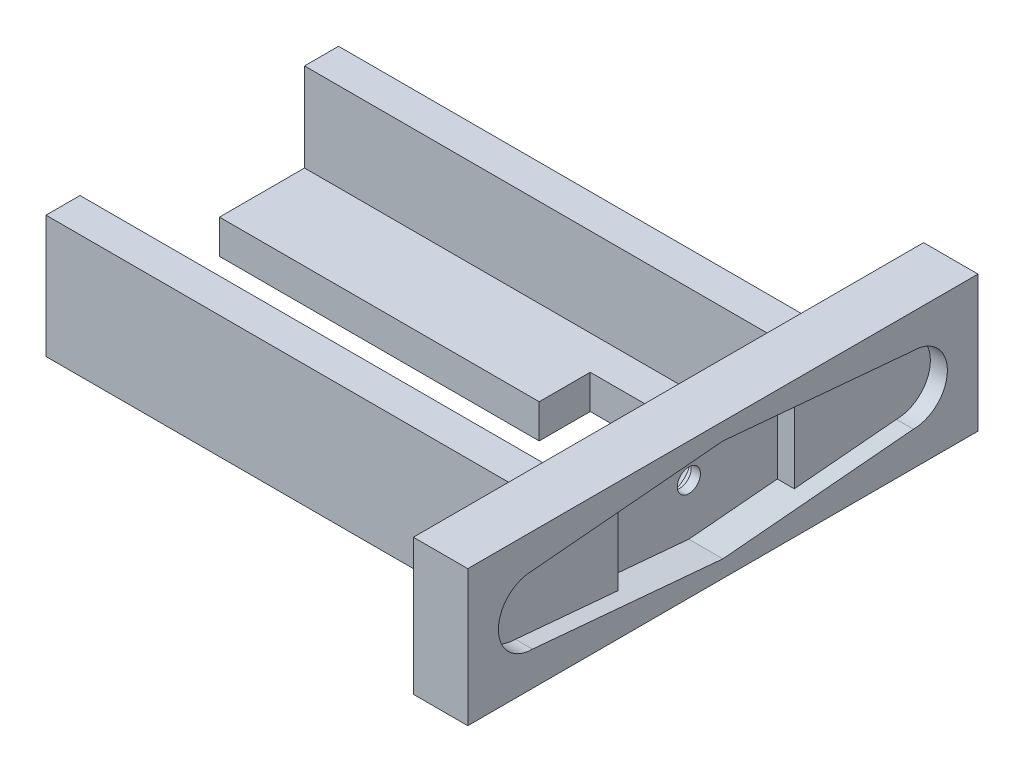
ISO-10303-21;
HEADER;
FILE_DESCRIPTION(('STEP AP214'),'2;1');
FILE_NAME('part.step','',(''),(''),'','','');
FILE_SCHEMA(('AUTOMOTIVE_DESIGN { 1 0 10303 214 1 1 1 1 }'));
ENDSEC;
DATA;
#1=APPLICATION_CONTEXT('core data for automotive mechanical design processes');
#2=APPLICATION_PROTOCOL_DEFINITION('international standard','automotive_design',2000,#1);
#3=PRODUCT_CONTEXT('',#1,'mechanical');
#4=PRODUCT('Part','Part','',(#3));
#5=PRODUCT_RELATED_PRODUCT_CATEGORY('part','',(#4));
#6=PRODUCT_DEFINITION_FORMATION('','',#4);
#7=PRODUCT_DEFINITION_CONTEXT('part definition',#1,'design');
#8=PRODUCT_DEFINITION('design','',#6,#7);
#9=PRODUCT_DEFINITION_SHAPE('','',#8);
#10=(LENGTH_UNIT() NAMED_UNIT(*) SI_UNIT(.MILLI.,.METRE.));
#11=(NAMED_UNIT(*) PLANE_ANGLE_UNIT() SI_UNIT($,.RADIAN.));
#12=(NAMED_UNIT(*) SI_UNIT($,.STERADIAN.) SOLID_ANGLE_UNIT());
#13=UNCERTAINTY_MEASURE_WITH_UNIT(LENGTH_MEASURE(1.E-05),#10,'distance_accuracy_value','');
#14=(GEOMETRIC_REPRESENTATION_CONTEXT(3) GLOBAL_UNCERTAINTY_ASSIGNED_CONTEXT((#13)) GLOBAL_UNIT_ASSIGNED_CONTEXT((#10,
#11,#12)) REPRESENTATION_CONTEXT('',''));
#15=CARTESIAN_POINT('',(0.,0.,0.));
#16=DIRECTION('',(0.,0.,1.));
#17=DIRECTION('',(1.,0.,0.));
#18=AXIS2_PLACEMENT_3D('',#15,#16,#17);
#19=CARTESIAN_POINT('',(-70.,-15.,-41.5));
#20=DIRECTION('',(0.,0.,-1.));
#21=DIRECTION('',(-1.,0.,0.));
#22=AXIS2_PLACEMENT_3D('',#19,#20,#21);
#23=PLANE('',#22);
#24=DIRECTION('',(1.,0.,0.));
#25=VECTOR('',#24,1.);
#26=CARTESIAN_POINT('',(0.,0.,-41.5));
#27=LINE('',#26,#25);
#28=CARTESIAN_POINT('',(-70.,0.,-41.5));
#29=VERTEX_POINT('',#28);
#30=CARTESIAN_POINT('',(-23.,0.,-41.5));
#31=VERTEX_POINT('',#30);
#32=EDGE_CURVE('E371',#29,#31,#27,.T.);
#33=ORIENTED_EDGE('',*,*,#32,.T.);
#34=DIRECTION('',(0.,1.,0.));
#35=VECTOR('',#34,1.);
#36=CARTESIAN_POINT('',(-23.,-15.,-41.5));
#37=LINE('',#36,#35);
#38=CARTESIAN_POINT('',(-23.,5.,-41.5));
#39=VERTEX_POINT('',#38);
#40=EDGE_CURVE('E335',#31,#39,#37,.T.);
#41=ORIENTED_EDGE('',*,*,#40,.T.);
#42=DIRECTION('',(-1.,0.,0.));
#43=VECTOR('',#42,1.);
#44=CARTESIAN_POINT('',(-70.,5.,-41.5));
#45=LINE('',#44,#43);
#46=CARTESIAN_POINT('',(-70.,5.,-41.5));
#47=VERTEX_POINT('',#46);
#48=EDGE_CURVE('E353',#39,#47,#45,.T.);
#49=ORIENTED_EDGE('',*,*,#48,.T.);
#50=DIRECTION('',(0.,-1.,0.));
#51=VECTOR('',#50,1.);
#52=CARTESIAN_POINT('',(-70.,0.,-41.5));
#53=LINE('',#52,#51);
#54=EDGE_CURVE('E614',#47,#29,#53,.T.);
#55=ORIENTED_EDGE('',*,*,#54,.T.);
#56=EDGE_LOOP('',(#33,#41,#49,#55));
#57=FACE_BOUND('',#56,.T.);
#58=ADVANCED_FACE('F55',(#57),#23,.F.);
#59=CARTESIAN_POINT('',(-70.,-15.,-33.5));
#60=DIRECTION('',(0.,0.,1.));
#61=DIRECTION('',(1.,0.,0.));
#62=AXIS2_PLACEMENT_3D('',#59,#60,#61);
#63=PLANE('',#62);
#64=DIRECTION('',(1.,0.,0.));
#65=VECTOR('',#64,1.);
#66=CARTESIAN_POINT('',(-70.,5.,-33.5));
#67=LINE('',#66,#65);
#68=CARTESIAN_POINT('',(-70.,5.,-33.5));
#69=VERTEX_POINT('',#68);
#70=CARTESIAN_POINT('',(-23.,5.,-33.5));
#71=VERTEX_POINT('',#70);
#72=EDGE_CURVE('E346',#69,#71,#67,.T.);
#73=ORIENTED_EDGE('',*,*,#72,.T.);
#74=DIRECTION('',(0.,-1.,0.));
#75=VECTOR('',#74,1.);
#76=CARTESIAN_POINT('',(-23.,-15.,-33.5));
#77=LINE('',#76,#75);
#78=CARTESIAN_POINT('',(-23.,0.,-33.5));
#79=VERTEX_POINT('',#78);
#80=EDGE_CURVE('E12',#71,#79,#77,.T.);
#81=ORIENTED_EDGE('',*,*,#80,.T.);
#82=DIRECTION('',(-1.,0.,0.));
#83=VECTOR('',#82,1.);
#84=CARTESIAN_POINT('',(0.,0.,-33.5));
#85=LINE('',#84,#83);
#86=CARTESIAN_POINT('',(-70.,0.,-33.5));
#87=VERTEX_POINT('',#86);
#88=EDGE_CURVE('E362',#79,#87,#85,.T.);
#89=ORIENTED_EDGE('',*,*,#88,.T.);
#90=DIRECTION('',(0.,1.,0.));
#91=VECTOR('',#90,1.);
#92=CARTESIAN_POINT('',(-70.,0.,-33.5));
#93=LINE('',#92,#91);
#94=EDGE_CURVE('E611',#87,#69,#93,.T.);
#95=ORIENTED_EDGE('',*,*,#94,.T.);
#96=EDGE_LOOP('',(#73,#81,#89,#95));
#97=FACE_BOUND('',#96,.T.);
#98=ADVANCED_FACE('F682',(#97),#63,.F.);
#99=CARTESIAN_POINT('',(-70.,0.,0.));
#100=DIRECTION('',(-1.,0.,0.));
#101=DIRECTION('',(0.,0.,1.));
#102=AXIS2_PLACEMENT_3D('',#99,#100,#101);
#103=PLANE('',#102);
#104=ORIENTED_EDGE('',*,*,#54,.F.);
#105=DIRECTION('',(0.,0.,-1.));
#106=VECTOR('',#105,1.);
#107=CARTESIAN_POINT('',(-70.,5.,-54.));
#108=LINE('',#107,#106);
#109=CARTESIAN_POINT('',(-70.,5.,-54.));
#110=VERTEX_POINT('',#109);
#111=EDGE_CURVE('E443',#47,#110,#108,.T.);
#112=ORIENTED_EDGE('',*,*,#111,.T.);
#113=DIRECTION('',(0.,1.,0.));
#114=VECTOR('',#113,1.);
#115=CARTESIAN_POINT('',(-70.,0.,-54.));
#116=LINE('',#115,#114);
#117=CARTESIAN_POINT('',(-70.,18.,-54.));
#118=VERTEX_POINT('',#117);
#119=EDGE_CURVE('E379',#110,#118,#116,.T.);
#120=ORIENTED_EDGE('',*,*,#119,.T.);
#121=DIRECTION('',(0.,0.,-1.));
#122=VECTOR('',#121,1.);
#123=CARTESIAN_POINT('',(-70.,18.,-54.));
#124=LINE('',#123,#122);
#125=CARTESIAN_POINT('',(-70.,18.,-59.));
#126=VERTEX_POINT('',#125);
#127=EDGE_CURVE('E382',#118,#126,#124,.T.);
#128=ORIENTED_EDGE('',*,*,#127,.T.);
#129=DIRECTION('',(0.,-1.,0.));
#130=VECTOR('',#129,1.);
#131=CARTESIAN_POINT('',(-70.,0.,-59.));
#132=LINE('',#131,#130);
#133=CARTESIAN_POINT('',(-70.,0.,-59.));
#134=VERTEX_POINT('',#133);
#135=EDGE_CURVE('E386',#126,#134,#132,.T.);
#136=ORIENTED_EDGE('',*,*,#135,.T.);
#137=DIRECTION('',(0.,0.,1.));
#138=VECTOR('',#137,1.);
#139=CARTESIAN_POINT('',(-70.,0.,-54.));
#140=LINE('',#139,#138);
#141=EDGE_CURVE('E439',#134,#29,#140,.T.);
#142=ORIENTED_EDGE('',*,*,#141,.T.);
#143=EDGE_LOOP('',(#104,#112,#120,#128,#136,#142));
#144=FACE_BOUND('',#143,.T.);
#145=ADVANCED_FACE('F651',(#144),#103,.T.);
#146=CARTESIAN_POINT('',(0.,20.,0.));
#147=DIRECTION('',(-1.,0.,0.));
#148=DIRECTION('',(0.,0.,1.));
#149=AXIS2_PLACEMENT_3D('',#146,#147,#148);
#150=PLANE('',#149);
#151=CARTESIAN_POINT('',(0.,10.,-37.5));
#152=DIRECTION('',(-1.,0.,0.));
#153=DIRECTION('',(0.,0.,1.));
#154=AXIS2_PLACEMENT_3D('',#151,#152,#153);
#155=CIRCLE('',#154,3.35);
#156=CARTESIAN_POINT('',(0.,10.,-34.15));
#157=VERTEX_POINT('',#156);
#158=EDGE_CURVE('E849',#157,#157,#155,.T.);
#159=ORIENTED_EDGE('',*,*,#158,.F.);
#160=EDGE_LOOP('',(#159));
#161=FACE_BOUND('',#160,.T.);
#162=DIRECTION('',(0.,0.,-1.));
#163=VECTOR('',#162,1.);
#164=CARTESIAN_POINT('',(0.,18.,-54.));
#165=LINE('',#164,#163);
#166=CARTESIAN_POINT('',(0.,18.,-54.));
#167=VERTEX_POINT('',#166);
#168=CARTESIAN_POINT('',(0.,18.,-59.));
#169=VERTEX_POINT('',#168);
#170=EDGE_CURVE('E393',#167,#169,#165,.T.);
#171=ORIENTED_EDGE('',*,*,#170,.F.);
#172=DIRECTION('',(0.,1.,0.));
#173=VECTOR('',#172,1.);
#174=CARTESIAN_POINT('',(0.,0.,-54.));
#175=LINE('',#174,#173);
#176=CARTESIAN_POINT('',(0.,5.,-54.));
#177=VERTEX_POINT('',#176);
#178=EDGE_CURVE('E378',#177,#167,#175,.T.);
#179=ORIENTED_EDGE('',*,*,#178,.F.);
#180=DIRECTION('',(0.,0.,-1.));
#181=VECTOR('',#180,1.);
#182=CARTESIAN_POINT('',(0.,5.,-54.));
#183=LINE('',#182,#181);
#184=CARTESIAN_POINT('',(0.,5.,-21.));
#185=VERTEX_POINT('',#184);
#186=EDGE_CURVE('E438',#185,#177,#183,.T.);
#187=ORIENTED_EDGE('',*,*,#186,.F.);
#188=DIRECTION('',(0.,-1.,0.));
#189=VECTOR('',#188,1.);
#190=CARTESIAN_POINT('',(0.,0.,-21.));
#191=LINE('',#190,#189);
#192=CARTESIAN_POINT('',(0.,18.,-21.));
#193=VERTEX_POINT('',#192);
#194=EDGE_CURVE('E409',#193,#185,#191,.T.);
#195=ORIENTED_EDGE('',*,*,#194,.F.);
#196=DIRECTION('',(0.,0.,-1.));
#197=VECTOR('',#196,1.);
#198=CARTESIAN_POINT('',(0.,18.,-21.));
#199=LINE('',#198,#197);
#200=CARTESIAN_POINT('',(0.,18.,-16.));
#201=VERTEX_POINT('',#200);
#202=EDGE_CURVE('E414',#201,#193,#199,.T.);
#203=ORIENTED_EDGE('',*,*,#202,.F.);
#204=DIRECTION('',(0.,1.,0.));
#205=VECTOR('',#204,1.);
#206=CARTESIAN_POINT('',(0.,0.,-16.));
#207=LINE('',#206,#205);
#208=CARTESIAN_POINT('',(0.,0.,-16.));
#209=VERTEX_POINT('',#208);
#210=EDGE_CURVE('E423',#209,#201,#207,.T.);
#211=ORIENTED_EDGE('',*,*,#210,.F.);
#212=DIRECTION('',(0.,0.,-1.));
#213=VECTOR('',#212,1.);
#214=CARTESIAN_POINT('',(0.,0.,0.));
#215=LINE('',#214,#213);
#216=CARTESIAN_POINT('',(0.,0.,0.));
#217=VERTEX_POINT('',#216);
#218=EDGE_CURVE('E588',#217,#209,#215,.T.);
#219=ORIENTED_EDGE('',*,*,#218,.F.);
#220=DIRECTION('',(0.,-1.,0.));
#221=VECTOR('',#220,1.);
#222=CARTESIAN_POINT('',(0.,20.,0.));
#223=LINE('',#222,#221);
#224=CARTESIAN_POINT('',(0.,20.,0.));
#225=VERTEX_POINT('',#224);
#226=EDGE_CURVE('E599',#225,#217,#223,.T.);
#227=ORIENTED_EDGE('',*,*,#226,.F.);
#228=DIRECTION('',(0.,0.,-1.));
#229=VECTOR('',#228,1.);
#230=CARTESIAN_POINT('',(0.,20.,0.));
#231=LINE('',#230,#229);
#232=CARTESIAN_POINT('',(0.,20.,-75.));
#233=VERTEX_POINT('',#232);
#234=EDGE_CURVE('E574',#225,#233,#231,.T.);
#235=ORIENTED_EDGE('',*,*,#234,.T.);
#236=DIRECTION('',(0.,-1.,0.));
#237=VECTOR('',#236,1.);
#238=CARTESIAN_POINT('',(0.,20.,-75.));
#239=LINE('',#238,#237);
#240=CARTESIAN_POINT('',(0.,0.,-75.));
#241=VERTEX_POINT('',#240);
#242=EDGE_CURVE('E587',#233,#241,#239,.T.);
#243=ORIENTED_EDGE('',*,*,#242,.T.);
#244=CARTESIAN_POINT('',(0.,0.,-59.));
#245=VERTEX_POINT('',#244);
#246=EDGE_CURVE('E573',#245,#241,#215,.T.);
#247=ORIENTED_EDGE('',*,*,#246,.F.);
#248=DIRECTION('',(0.,-1.,0.));
#249=VECTOR('',#248,1.);
#250=CARTESIAN_POINT('',(0.,0.,-59.));
#251=LINE('',#250,#249);
#252=EDGE_CURVE('E383',#169,#245,#251,.T.);
#253=ORIENTED_EDGE('',*,*,#252,.F.);
#254=EDGE_LOOP('',(#171,#179,#187,#195,#203,#211,#219,#227,#235,#243,#247,#253));
#255=FACE_BOUND('',#254,.T.);
#256=ADVANCED_FACE('F57',(#161,#255),#150,.T.);
#257=CARTESIAN_POINT('',(5.50000000000001,0.,0.));
#258=DIRECTION('',(1.,0.,0.));
#259=DIRECTION('',(0.,0.,-1.));
#260=AXIS2_PLACEMENT_3D('',#257,#258,#259);
#261=PLANE('',#260);
#262=DIRECTION('',(0.,-1.,0.));
#263=VECTOR('',#262,1.);
#264=CARTESIAN_POINT('',(5.50000000000001,0.,-24.551509830912));
#265=LINE('',#264,#263);
#266=CARTESIAN_POINT('',(5.50000000000001,16.3438848063314,-24.551509830912));
#267=VERTEX_POINT('',#266);
#268=CARTESIAN_POINT('',(5.50000000000001,3.65611519366857,-24.551509830912));
#269=VERTEX_POINT('',#268);
#270=EDGE_CURVE('E608',#267,#269,#265,.T.);
#271=ORIENTED_EDGE('',*,*,#270,.F.);
#272=DIRECTION('',(0.,0.0889319379745051,-0.996037705314462));
#273=VECTOR('',#272,1.);
#274=CARTESIAN_POINT('',(5.50000000000001,14.0398608035432,1.25355900031635));
#275=LINE('',#274,#273);
#276=CARTESIAN_POINT('',(5.50000000000001,15.,-9.5));
#277=VERTEX_POINT('',#276);
#278=EDGE_CURVE('E510',#277,#267,#275,.T.);
#279=ORIENTED_EDGE('',*,*,#278,.F.);
#280=CARTESIAN_POINT('',(5.50000000000001,10.,-9.5));
#281=DIRECTION('',(1.,0.,0.));
#282=DIRECTION('',(0.,0.,-1.));
#283=AXIS2_PLACEMENT_3D('',#280,#281,#282);
#284=CIRCLE('',#283,5.00000000000001);
#285=CARTESIAN_POINT('',(5.50000000000001,4.99999999999999,-9.5));
#286=VERTEX_POINT('',#285);
#287=EDGE_CURVE('E514',#286,#277,#284,.F.);
#288=ORIENTED_EDGE('',*,*,#287,.F.);
#289=DIRECTION('',(0.,0.0889319379745051,0.996037705314462));
#290=VECTOR('',#289,1.);
#291=CARTESIAN_POINT('',(5.50000000000001,5.80196140461878,-0.518032268269531));
#292=LINE('',#291,#290);
#293=EDGE_CURVE('E517',#269,#286,#292,.T.);
#294=ORIENTED_EDGE('',*,*,#293,.F.);
#295=EDGE_LOOP('',(#271,#279,#288,#294));
#296=FACE_BOUND('',#295,.T.);
#297=ADVANCED_FACE('F753',(#296),#261,.T.);
#298=CARTESIAN_POINT('',(8.00000000000001,0.,0.));
#299=DIRECTION('',(1.,0.,0.));
#300=DIRECTION('',(0.,0.,-1.));
#301=AXIS2_PLACEMENT_3D('',#298,#299,#300);
#302=PLANE('',#301);
#303=DIRECTION('',(0.,-1.,0.));
#304=VECTOR('',#303,1.);
#305=CARTESIAN_POINT('',(8.00000000000001,0.,0.));
#306=LINE('',#305,#304);
#307=CARTESIAN_POINT('',(8.00000000000001,20.,0.));
#308=VERTEX_POINT('',#307);
#309=CARTESIAN_POINT('',(8.00000000000001,0.,0.));
#310=VERTEX_POINT('',#309);
#311=EDGE_CURVE('E543',#308,#310,#306,.T.);
#312=ORIENTED_EDGE('',*,*,#311,.T.);
#313=DIRECTION('',(0.,0.,-1.));
#314=VECTOR('',#313,1.);
#315=CARTESIAN_POINT('',(8.00000000000001,0.,0.));
#316=LINE('',#315,#314);
#317=CARTESIAN_POINT('',(8.00000000000001,0.,-75.));
#318=VERTEX_POINT('',#317);
#319=EDGE_CURVE('E564',#310,#318,#316,.T.);
#320=ORIENTED_EDGE('',*,*,#319,.T.);
#321=DIRECTION('',(0.,1.,0.));
#322=VECTOR('',#321,1.);
#323=CARTESIAN_POINT('',(8.00000000000001,0.,-75.));
#324=LINE('',#323,#322);
#325=CARTESIAN_POINT('',(8.00000000000001,20.,-75.));
#326=VERTEX_POINT('',#325);
#327=EDGE_CURVE('E567',#318,#326,#324,.T.);
#328=ORIENTED_EDGE('',*,*,#327,.T.);
#329=DIRECTION('',(0.,0.,1.));
#330=VECTOR('',#329,1.);
#331=CARTESIAN_POINT('',(8.00000000000001,20.,0.));
#332=LINE('',#331,#330);
#333=EDGE_CURVE('E570',#326,#308,#332,.T.);
#334=ORIENTED_EDGE('',*,*,#333,.T.);
#335=EDGE_LOOP('',(#312,#320,#328,#334));
#336=FACE_BOUND('',#335,.T.);
#337=CARTESIAN_POINT('',(8.00000000000001,10.,-65.5));
#338=DIRECTION('',(1.,0.,0.));
#339=DIRECTION('',(0.,0.,-1.));
#340=AXIS2_PLACEMENT_3D('',#337,#338,#339);
#341=CIRCLE('',#340,4.99999999999999);
#342=CARTESIAN_POINT('',(8.00000000000001,5.00000000000001,-65.5));
#343=VERTEX_POINT('',#342);
#344=CARTESIAN_POINT('',(8.00000000000001,15.,-65.5));
#345=VERTEX_POINT('',#344);
#346=EDGE_CURVE('E523',#343,#345,#341,.T.);
#347=ORIENTED_EDGE('',*,*,#346,.F.);
#348=DIRECTION('',(0.,-0.0889319379745058,0.996037705314462));
#349=VECTOR('',#348,1.);
#350=CARTESIAN_POINT('',(8.00000000000001,-0.841505852578306,-0.0751344511230632));
#351=LINE('',#350,#349);
#352=CARTESIAN_POINT('',(8.00000000000001,2.5,-37.5));
#353=VERTEX_POINT('',#352);
#354=EDGE_CURVE('E488',#343,#353,#351,.T.);
#355=ORIENTED_EDGE('',*,*,#354,.T.);
#356=DIRECTION('',(0.,0.0889319379745051,0.996037705314462));
#357=VECTOR('',#356,1.);
#358=CARTESIAN_POINT('',(8.00000000000001,5.80196140461878,-0.518032268269531));
#359=LINE('',#358,#357);
#360=CARTESIAN_POINT('',(8.00000000000001,4.99999999999999,-9.5));
#361=VERTEX_POINT('',#360);
#362=EDGE_CURVE('E503',#353,#361,#359,.T.);
#363=ORIENTED_EDGE('',*,*,#362,.T.);
#364=CARTESIAN_POINT('',(8.00000000000001,10.,-9.5));
#365=DIRECTION('',(1.,0.,0.));
#366=DIRECTION('',(0.,0.,-1.));
#367=AXIS2_PLACEMENT_3D('',#364,#365,#366);
#368=CIRCLE('',#367,5.00000000000001);
#369=CARTESIAN_POINT('',(8.00000000000001,15.,-9.5));
#370=VERTEX_POINT('',#369);
#371=EDGE_CURVE('E533',#361,#370,#368,.F.);
#372=ORIENTED_EDGE('',*,*,#371,.T.);
#373=DIRECTION('',(0.,0.0889319379745051,-0.996037705314462));
#374=VECTOR('',#373,1.);
#375=CARTESIAN_POINT('',(8.00000000000001,14.0398608035432,1.25355900031635));
#376=LINE('',#375,#374);
#377=CARTESIAN_POINT('',(8.00000000000001,17.5,-37.5));
#378=VERTEX_POINT('',#377);
#379=EDGE_CURVE('E530',#370,#378,#376,.T.);
#380=ORIENTED_EDGE('',*,*,#379,.T.);
#381=DIRECTION('',(0.,-0.0889319379745058,-0.996037705314462));
#382=VECTOR('',#381,1.);
#383=CARTESIAN_POINT('',(8.00000000000001,20.6833280607403,-1.84672571970896));
#384=LINE('',#383,#382);
#385=EDGE_CURVE('E527',#378,#345,#384,.T.);
#386=ORIENTED_EDGE('',*,*,#385,.T.);
#387=EDGE_LOOP('',(#347,#355,#363,#372,#380,#386));
#388=FACE_BOUND('',#387,.T.);
#389=ADVANCED_FACE('F777',(#336,#388),#302,.T.);
#390=CARTESIAN_POINT('',(0.,20.,0.));
#391=DIRECTION('',(0.,0.,-1.));
#392=DIRECTION('',(-1.,0.,0.));
#393=AXIS2_PLACEMENT_3D('',#390,#391,#392);
#394=PLANE('',#393);
#395=ORIENTED_EDGE('',*,*,#311,.F.);
#396=DIRECTION('',(1.,0.,0.));
#397=VECTOR('',#396,1.);
#398=CARTESIAN_POINT('',(0.,20.,0.));
#399=LINE('',#398,#397);
#400=EDGE_CURVE('E583',#225,#308,#399,.T.);
#401=ORIENTED_EDGE('',*,*,#400,.F.);
#402=ORIENTED_EDGE('',*,*,#226,.T.);
#403=DIRECTION('',(1.,0.,0.));
#404=VECTOR('',#403,1.);
#405=CARTESIAN_POINT('',(0.,0.,0.));
#406=LINE('',#405,#404);
#407=EDGE_CURVE('E579',#217,#310,#406,.T.);
#408=ORIENTED_EDGE('',*,*,#407,.T.);
#409=EDGE_LOOP('',(#395,#401,#402,#408));
#410=FACE_BOUND('',#409,.T.);
#411=ADVANCED_FACE('F780',(#410),#394,.F.);
#412=CARTESIAN_POINT('',(0.,20.,-75.));
#413=DIRECTION('',(0.,0.,-1.));
#414=DIRECTION('',(-1.,0.,0.));
#415=AXIS2_PLACEMENT_3D('',#412,#413,#414);
#416=PLANE('',#415);
#417=DIRECTION('',(1.,0.,0.));
#418=VECTOR('',#417,1.);
#419=CARTESIAN_POINT('',(0.,20.,-75.));
#420=LINE('',#419,#418);
#421=EDGE_CURVE('E578',#233,#326,#420,.T.);
#422=ORIENTED_EDGE('',*,*,#421,.T.);
#423=ORIENTED_EDGE('',*,*,#327,.F.);
#424=DIRECTION('',(1.,0.,0.));
#425=VECTOR('',#424,1.);
#426=CARTESIAN_POINT('',(0.,0.,-75.));
#427=LINE('',#426,#425);
#428=EDGE_CURVE('E592',#241,#318,#427,.T.);
#429=ORIENTED_EDGE('',*,*,#428,.F.);
#430=ORIENTED_EDGE('',*,*,#242,.F.);
#431=EDGE_LOOP('',(#422,#423,#429,#430));
#432=FACE_BOUND('',#431,.T.);
#433=ADVANCED_FACE('F785',(#432),#416,.T.);
#434=CARTESIAN_POINT('',(0.,20.,0.));
#435=DIRECTION('',(0.,-1.,0.));
#436=DIRECTION('',(0.,0.,-1.));
#437=AXIS2_PLACEMENT_3D('',#434,#435,#436);
#438=PLANE('',#437);
#439=ORIENTED_EDGE('',*,*,#333,.F.);
#440=ORIENTED_EDGE('',*,*,#421,.F.);
#441=ORIENTED_EDGE('',*,*,#234,.F.);
#442=ORIENTED_EDGE('',*,*,#400,.T.);
#443=EDGE_LOOP('',(#439,#440,#441,#442));
#444=FACE_BOUND('',#443,.T.);
#445=ADVANCED_FACE('F782',(#444),#438,.F.);
#446=CARTESIAN_POINT('',(0.,0.,0.));
#447=DIRECTION('',(0.,-1.,0.));
#448=DIRECTION('',(0.,0.,-1.));
#449=AXIS2_PLACEMENT_3D('',#446,#447,#448);
#450=PLANE('',#449);
#451=DIRECTION('',(0.,0.,-1.));
#452=VECTOR('',#451,1.);
#453=CARTESIAN_POINT('',(-23.,0.,0.));
#454=LINE('',#453,#452);
#455=CARTESIAN_POINT('',(-23.,0.,-49.));
#456=VERTEX_POINT('',#455);
#457=EDGE_CURVE('E336',#31,#456,#454,.T.);
#458=ORIENTED_EDGE('',*,*,#457,.F.);
#459=ORIENTED_EDGE('',*,*,#32,.F.);
#460=ORIENTED_EDGE('',*,*,#141,.F.);
#461=DIRECTION('',(1.,0.,0.));
#462=VECTOR('',#461,1.);
#463=CARTESIAN_POINT('',(-70.,0.,-59.));
#464=LINE('',#463,#462);
#465=EDGE_CURVE('E390',#134,#245,#464,.T.);
#466=ORIENTED_EDGE('',*,*,#465,.T.);
#467=ORIENTED_EDGE('',*,*,#246,.T.);
#468=ORIENTED_EDGE('',*,*,#428,.T.);
#469=ORIENTED_EDGE('',*,*,#319,.F.);
#470=ORIENTED_EDGE('',*,*,#407,.F.);
#471=ORIENTED_EDGE('',*,*,#218,.T.);
#472=DIRECTION('',(1.,0.,0.));
#473=VECTOR('',#472,1.);
#474=CARTESIAN_POINT('',(-70.,0.,-16.));
#475=LINE('',#474,#473);
#476=CARTESIAN_POINT('',(-70.,0.,-16.));
#477=VERTEX_POINT('',#476);
#478=EDGE_CURVE('E435',#477,#209,#475,.T.);
#479=ORIENTED_EDGE('',*,*,#478,.F.);
#480=EDGE_CURVE('E444',#87,#477,#140,.T.);
#481=ORIENTED_EDGE('',*,*,#480,.F.);
#482=ORIENTED_EDGE('',*,*,#88,.F.);
#483=CARTESIAN_POINT('',(-23.,0.,-27.239319023099));
#484=VERTEX_POINT('',#483);
#485=EDGE_CURVE('E332',#484,#79,#454,.T.);
#486=ORIENTED_EDGE('',*,*,#485,.F.);
#487=DIRECTION('',(-1.,0.,0.));
#488=VECTOR('',#487,1.);
#489=CARTESIAN_POINT('',(0.,0.,-27.239319023099));
#490=LINE('',#489,#488);
#491=CARTESIAN_POINT('',(-13.,0.,-27.239319023099));
#492=VERTEX_POINT('',#491);
#493=EDGE_CURVE('E286',#492,#484,#490,.T.);
#494=ORIENTED_EDGE('',*,*,#493,.F.);
#495=DIRECTION('',(0.,0.,1.));
#496=VECTOR('',#495,1.);
#497=CARTESIAN_POINT('',(-13.,0.,0.));
#498=LINE('',#497,#496);
#499=CARTESIAN_POINT('',(-13.,0.,-33.5));
#500=VERTEX_POINT('',#499);
#501=EDGE_CURVE('E321',#500,#492,#498,.T.);
#502=ORIENTED_EDGE('',*,*,#501,.F.);
#503=CARTESIAN_POINT('',(-10.,0.,-33.5));
#504=VERTEX_POINT('',#503);
#505=EDGE_CURVE('E366',#504,#500,#85,.T.);
#506=ORIENTED_EDGE('',*,*,#505,.F.);
#507=DIRECTION('',(0.,0.,1.));
#508=VECTOR('',#507,1.);
#509=CARTESIAN_POINT('',(-10.,0.,0.));
#510=LINE('',#509,#508);
#511=CARTESIAN_POINT('',(-10.,0.,-41.5));
#512=VERTEX_POINT('',#511);
#513=EDGE_CURVE('E375',#512,#504,#510,.T.);
#514=ORIENTED_EDGE('',*,*,#513,.F.);
#515=CARTESIAN_POINT('',(-13.,0.,-41.5));
#516=VERTEX_POINT('',#515);
#517=EDGE_CURVE('E370',#516,#512,#27,.T.);
#518=ORIENTED_EDGE('',*,*,#517,.F.);
#519=CARTESIAN_POINT('',(-13.,0.,-49.));
#520=VERTEX_POINT('',#519);
#521=EDGE_CURVE('E72',#520,#516,#498,.T.);
#522=ORIENTED_EDGE('',*,*,#521,.F.);
#523=DIRECTION('',(1.,0.,0.));
#524=VECTOR('',#523,1.);
#525=CARTESIAN_POINT('',(0.,0.,-49.));
#526=LINE('',#525,#524);
#527=EDGE_CURVE('E342',#456,#520,#526,.T.);
#528=ORIENTED_EDGE('',*,*,#527,.F.);
#529=EDGE_LOOP('',(#458,#459,#460,#466,#467,#468,#469,#470,#471,#479,#481,#482,#486,#494,#502,
#506,#514,#518,#522,#528));
#530=FACE_BOUND('',#529,.T.);
#531=ADVANCED_FACE('F639',(#530),#450,.T.);
#532=CARTESIAN_POINT('',(5.50000000000001,-0.841505852578306,-0.0751344511230632));
#533=DIRECTION('',(0.,0.996037705314462,0.0889319379745058));
#534=DIRECTION('',(0.,-0.0889319379745058,0.996037705314462));
#535=AXIS2_PLACEMENT_3D('',#532,#533,#534);
#536=PLANE('',#535);
#537=DIRECTION('',(0.,-0.0889319379745058,0.996037705314462));
#538=VECTOR('',#537,1.);
#539=CARTESIAN_POINT('',(5.50000000000001,-0.841505852578306,-0.0751344511230632));
#540=LINE('',#539,#538);
#541=CARTESIAN_POINT('',(5.50000000000001,5.00000000000001,-65.5));
#542=VERTEX_POINT('',#541);
#543=CARTESIAN_POINT('',(5.50000000000001,3.66071428571429,-50.5));
#544=VERTEX_POINT('',#543);
#545=EDGE_CURVE('E498',#542,#544,#540,.T.);
#546=ORIENTED_EDGE('',*,*,#545,.T.);
#547=DIRECTION('',(1.,0.,0.));
#548=VECTOR('',#547,1.);
#549=CARTESIAN_POINT('',(3.00000000000001,3.66071428571429,-50.5));
#550=LINE('',#549,#548);
#551=CARTESIAN_POINT('',(3.00000000000001,3.66071428571429,-50.5));
#552=VERTEX_POINT('',#551);
#553=EDGE_CURVE('E483',#552,#544,#550,.T.);
#554=ORIENTED_EDGE('',*,*,#553,.F.);
#555=DIRECTION('',(0.,0.0889319379745059,-0.996037705314462));
#556=VECTOR('',#555,1.);
#557=CARTESIAN_POINT('',(3.00000000000001,2.5,-37.5));
#558=LINE('',#557,#556);
#559=CARTESIAN_POINT('',(3.00000000000001,2.5,-37.5));
#560=VERTEX_POINT('',#559);
#561=EDGE_CURVE('E459',#560,#552,#558,.T.);
#562=ORIENTED_EDGE('',*,*,#561,.F.);
#563=DIRECTION('',(1.,0.,0.));
#564=VECTOR('',#563,1.);
#565=CARTESIAN_POINT('',(5.50000000000001,2.5,-37.5));
#566=LINE('',#565,#564);
#567=EDGE_CURVE('E539',#560,#353,#566,.T.);
#568=ORIENTED_EDGE('',*,*,#567,.T.);
#569=ORIENTED_EDGE('',*,*,#354,.F.);
#570=DIRECTION('',(1.,0.,0.));
#571=VECTOR('',#570,1.);
#572=CARTESIAN_POINT('',(5.50000000000001,5.00000000000001,-65.5));
#573=LINE('',#572,#571);
#574=EDGE_CURVE('E520',#542,#343,#573,.T.);
#575=ORIENTED_EDGE('',*,*,#574,.F.);
#576=EDGE_LOOP('',(#546,#554,#562,#568,#569,#575));
#577=FACE_BOUND('',#576,.T.);
#578=ADVANCED_FACE('F758',(#577),#536,.T.);
#579=CARTESIAN_POINT('',(5.50000000000001,5.80196140461878,-0.518032268269531));
#580=DIRECTION('',(0.,0.996037705314462,-0.0889319379745051));
#581=DIRECTION('',(0.,0.0889319379745051,0.996037705314462));
#582=AXIS2_PLACEMENT_3D('',#579,#580,#581);
#583=PLANE('',#582);
#584=DIRECTION('',(1.,0.,0.));
#585=VECTOR('',#584,1.);
#586=CARTESIAN_POINT('',(5.50000000000001,4.99999999999999,-9.5));
#587=LINE('',#586,#585);
#588=EDGE_CURVE('E544',#286,#361,#587,.T.);
#589=ORIENTED_EDGE('',*,*,#588,.T.);
#590=ORIENTED_EDGE('',*,*,#362,.F.);
#591=ORIENTED_EDGE('',*,*,#567,.F.);
#592=DIRECTION('',(0.,-0.0889319379745051,-0.996037705314462));
#593=VECTOR('',#592,1.);
#594=CARTESIAN_POINT('',(3.00000000000001,3.65611519366857,-24.551509830912));
#595=LINE('',#594,#593);
#596=CARTESIAN_POINT('',(3.00000000000001,3.65611519366857,-24.551509830912));
#597=VERTEX_POINT('',#596);
#598=EDGE_CURVE('E479',#597,#560,#595,.T.);
#599=ORIENTED_EDGE('',*,*,#598,.F.);
#600=DIRECTION('',(1.,0.,0.));
#601=VECTOR('',#600,1.);
#602=CARTESIAN_POINT('',(3.00000000000001,3.65611519366857,-24.551509830912));
#603=LINE('',#602,#601);
#604=EDGE_CURVE('E484',#597,#269,#603,.T.);
#605=ORIENTED_EDGE('',*,*,#604,.T.);
#606=ORIENTED_EDGE('',*,*,#293,.T.);
#607=EDGE_LOOP('',(#589,#590,#591,#599,#605,#606));
#608=FACE_BOUND('',#607,.T.);
#609=ADVANCED_FACE('F754',(#608),#583,.T.);
#610=CARTESIAN_POINT('',(5.50000000000001,10.,-9.5));
#611=DIRECTION('',(1.,0.,0.));
#612=DIRECTION('',(0.,0.,-1.));
#613=AXIS2_PLACEMENT_3D('',#610,#611,#612);
#614=CYLINDRICAL_SURFACE('',#613,5.00000000000001);
#615=ORIENTED_EDGE('',*,*,#371,.F.);
#616=ORIENTED_EDGE('',*,*,#588,.F.);
#617=ORIENTED_EDGE('',*,*,#287,.T.);
#618=DIRECTION('',(1.,0.,0.));
#619=VECTOR('',#618,1.);
#620=CARTESIAN_POINT('',(5.50000000000001,15.,-9.5));
#621=LINE('',#620,#619);
#622=EDGE_CURVE('E548',#277,#370,#621,.T.);
#623=ORIENTED_EDGE('',*,*,#622,.T.);
#624=EDGE_LOOP('',(#615,#616,#617,#623));
#625=FACE_BOUND('',#624,.T.);
#626=ADVANCED_FACE('F757',(#625),#614,.F.);
#627=CARTESIAN_POINT('',(5.50000000000001,14.0398608035432,1.25355900031635));
#628=DIRECTION('',(0.,-0.996037705314462,-0.0889319379745051));
#629=DIRECTION('',(0.,0.0889319379745051,-0.996037705314462));
#630=AXIS2_PLACEMENT_3D('',#627,#628,#629);
#631=PLANE('',#630);
#632=ORIENTED_EDGE('',*,*,#278,.T.);
#633=DIRECTION('',(1.,0.,0.));
#634=VECTOR('',#633,1.);
#635=CARTESIAN_POINT('',(3.00000000000001,16.3438848063314,-24.551509830912));
#636=LINE('',#635,#634);
#637=CARTESIAN_POINT('',(3.00000000000001,16.3438848063314,-24.551509830912));
#638=VERTEX_POINT('',#637);
#639=EDGE_CURVE('E489',#638,#267,#636,.T.);
#640=ORIENTED_EDGE('',*,*,#639,.F.);
#641=DIRECTION('',(0.,-0.0889319379745054,0.996037705314462));
#642=VECTOR('',#641,1.);
#643=CARTESIAN_POINT('',(3.00000000000001,17.5,-37.5));
#644=LINE('',#643,#642);
#645=CARTESIAN_POINT('',(3.00000000000001,17.5,-37.5));
#646=VERTEX_POINT('',#645);
#647=EDGE_CURVE('E471',#646,#638,#644,.T.);
#648=ORIENTED_EDGE('',*,*,#647,.F.);
#649=DIRECTION('',(1.,0.,0.));
#650=VECTOR('',#649,1.);
#651=CARTESIAN_POINT('',(5.50000000000001,17.5,-37.5));
#652=LINE('',#651,#650);
#653=EDGE_CURVE('E551',#646,#378,#652,.T.);
#654=ORIENTED_EDGE('',*,*,#653,.T.);
#655=ORIENTED_EDGE('',*,*,#379,.F.);
#656=ORIENTED_EDGE('',*,*,#622,.F.);
#657=EDGE_LOOP('',(#632,#640,#648,#654,#655,#656));
#658=FACE_BOUND('',#657,.T.);
#659=ADVANCED_FACE('F762',(#658),#631,.T.);
#660=CARTESIAN_POINT('',(5.50000000000001,20.6833280607403,-1.84672571970896));
#661=DIRECTION('',(0.,-0.996037705314462,0.0889319379745058));
#662=DIRECTION('',(0.,-0.0889319379745058,-0.996037705314462));
#663=AXIS2_PLACEMENT_3D('',#660,#661,#662);
#664=PLANE('',#663);
#665=DIRECTION('',(1.,0.,0.));
#666=VECTOR('',#665,1.);
#667=CARTESIAN_POINT('',(5.50000000000001,15.,-65.5));
#668=LINE('',#667,#666);
#669=CARTESIAN_POINT('',(5.50000000000001,15.,-65.5));
#670=VERTEX_POINT('',#669);
#671=EDGE_CURVE('E555',#670,#345,#668,.T.);
#672=ORIENTED_EDGE('',*,*,#671,.T.);
#673=ORIENTED_EDGE('',*,*,#385,.F.);
#674=ORIENTED_EDGE('',*,*,#653,.F.);
#675=DIRECTION('',(0.,0.0889319379745058,0.996037705314462));
#676=VECTOR('',#675,1.);
#677=CARTESIAN_POINT('',(3.00000000000001,16.3392857142857,-50.5));
#678=LINE('',#677,#676);
#679=CARTESIAN_POINT('',(3.00000000000001,16.3392857142857,-50.5));
#680=VERTEX_POINT('',#679);
#681=EDGE_CURVE('E467',#680,#646,#678,.T.);
#682=ORIENTED_EDGE('',*,*,#681,.F.);
#683=DIRECTION('',(1.,0.,0.));
#684=VECTOR('',#683,1.);
#685=CARTESIAN_POINT('',(3.00000000000001,16.3392857142857,-50.5));
#686=LINE('',#685,#684);
#687=CARTESIAN_POINT('',(5.50000000000001,16.3392857142857,-50.5));
#688=VERTEX_POINT('',#687);
#689=EDGE_CURVE('E492',#680,#688,#686,.T.);
#690=ORIENTED_EDGE('',*,*,#689,.T.);
#691=DIRECTION('',(0.,-0.0889319379745058,-0.996037705314462));
#692=VECTOR('',#691,1.);
#693=CARTESIAN_POINT('',(5.50000000000001,20.6833280607403,-1.84672571970896));
#694=LINE('',#693,#692);
#695=EDGE_CURVE('E507',#688,#670,#694,.T.);
#696=ORIENTED_EDGE('',*,*,#695,.T.);
#697=EDGE_LOOP('',(#672,#673,#674,#682,#690,#696));
#698=FACE_BOUND('',#697,.T.);
#699=ADVANCED_FACE('F766',(#698),#664,.T.);
#700=CARTESIAN_POINT('',(5.50000000000001,10.,-65.5));
#701=DIRECTION('',(1.,0.,0.));
#702=DIRECTION('',(0.,0.,-1.));
#703=AXIS2_PLACEMENT_3D('',#700,#701,#702);
#704=CYLINDRICAL_SURFACE('',#703,4.99999999999999);
#705=ORIENTED_EDGE('',*,*,#346,.T.);
#706=ORIENTED_EDGE('',*,*,#671,.F.);
#707=CARTESIAN_POINT('',(5.50000000000001,10.,-65.5));
#708=DIRECTION('',(1.,0.,0.));
#709=DIRECTION('',(0.,0.,-1.));
#710=AXIS2_PLACEMENT_3D('',#707,#708,#709);
#711=CIRCLE('',#710,4.99999999999999);
#712=EDGE_CURVE('E502',#542,#670,#711,.T.);
#713=ORIENTED_EDGE('',*,*,#712,.F.);
#714=ORIENTED_EDGE('',*,*,#574,.T.);
#715=EDGE_LOOP('',(#705,#706,#713,#714));
#716=FACE_BOUND('',#715,.T.);
#717=ADVANCED_FACE('F751',(#716),#704,.F.);
#718=DIRECTION('',(0.,1.,0.));
#719=VECTOR('',#718,1.);
#720=CARTESIAN_POINT('',(5.50000000000001,0.,-50.5));
#721=LINE('',#720,#719);
#722=EDGE_CURVE('E602',#544,#688,#721,.T.);
#723=ORIENTED_EDGE('',*,*,#722,.F.);
#724=ORIENTED_EDGE('',*,*,#545,.F.);
#725=ORIENTED_EDGE('',*,*,#712,.T.);
#726=ORIENTED_EDGE('',*,*,#695,.F.);
#727=EDGE_LOOP('',(#723,#724,#725,#726));
#728=FACE_BOUND('',#727,.T.);
#729=ADVANCED_FACE('F744',(#728),#261,.T.);
#730=CARTESIAN_POINT('',(3.00000000000001,16.3438848063314,-24.551509830912));
#731=DIRECTION('',(0.,0.,1.));
#732=DIRECTION('',(1.,0.,0.));
#733=AXIS2_PLACEMENT_3D('',#730,#731,#732);
#734=PLANE('',#733);
#735=ORIENTED_EDGE('',*,*,#270,.T.);
#736=ORIENTED_EDGE('',*,*,#604,.F.);
#737=DIRECTION('',(0.,-1.,0.));
#738=VECTOR('',#737,1.);
#739=CARTESIAN_POINT('',(3.00000000000001,16.3438848063314,-24.551509830912));
#740=LINE('',#739,#738);
#741=EDGE_CURVE('E475',#638,#597,#740,.T.);
#742=ORIENTED_EDGE('',*,*,#741,.F.);
#743=ORIENTED_EDGE('',*,*,#639,.T.);
#744=EDGE_LOOP('',(#735,#736,#742,#743));
#745=FACE_BOUND('',#744,.T.);
#746=ADVANCED_FACE('F741',(#745),#734,.F.);
#747=CARTESIAN_POINT('',(3.00000000000001,3.66071428571429,-50.5));
#748=DIRECTION('',(0.,0.,-1.));
#749=DIRECTION('',(-1.,0.,0.));
#750=AXIS2_PLACEMENT_3D('',#747,#748,#749);
#751=PLANE('',#750);
#752=ORIENTED_EDGE('',*,*,#722,.T.);
#753=ORIENTED_EDGE('',*,*,#689,.F.);
#754=DIRECTION('',(0.,1.,0.));
#755=VECTOR('',#754,1.);
#756=CARTESIAN_POINT('',(3.00000000000001,3.66071428571429,-50.5));
#757=LINE('',#756,#755);
#758=EDGE_CURVE('E463',#552,#680,#757,.T.);
#759=ORIENTED_EDGE('',*,*,#758,.F.);
#760=ORIENTED_EDGE('',*,*,#553,.T.);
#761=EDGE_LOOP('',(#752,#753,#759,#760));
#762=FACE_BOUND('',#761,.T.);
#763=ADVANCED_FACE('F739',(#762),#751,.F.);
#764=CARTESIAN_POINT('',(3.00000000000001,0.,0.));
#765=DIRECTION('',(1.,0.,0.));
#766=DIRECTION('',(0.,0.,-1.));
#767=AXIS2_PLACEMENT_3D('',#764,#765,#766);
#768=PLANE('',#767);
#769=CARTESIAN_POINT('',(3.00000000000001,10.,-37.5));
#770=DIRECTION('',(1.,0.,0.));
#771=DIRECTION('',(0.,0.,-1.));
#772=AXIS2_PLACEMENT_3D('',#769,#770,#771);
#773=CIRCLE('',#772,1.7);
#774=CARTESIAN_POINT('',(3.00000000000001,10.,-39.2));
#775=VERTEX_POINT('',#774);
#776=EDGE_CURVE('E59',#775,#775,#773,.T.);
#777=ORIENTED_EDGE('',*,*,#776,.F.);
#778=EDGE_LOOP('',(#777));
#779=FACE_BOUND('',#778,.T.);
#780=ORIENTED_EDGE('',*,*,#561,.T.);
#781=ORIENTED_EDGE('',*,*,#758,.T.);
#782=ORIENTED_EDGE('',*,*,#681,.T.);
#783=ORIENTED_EDGE('',*,*,#647,.T.);
#784=ORIENTED_EDGE('',*,*,#741,.T.);
#785=ORIENTED_EDGE('',*,*,#598,.T.);
#786=EDGE_LOOP('',(#780,#781,#782,#783,#784,#785));
#787=FACE_BOUND('',#786,.T.);
#788=ADVANCED_FACE('F736',(#779,#787),#768,.T.);
#789=CARTESIAN_POINT('',(-70.,5.,-54.));
#790=DIRECTION('',(0.,-1.,0.));
#791=DIRECTION('',(0.,0.,-1.));
#792=AXIS2_PLACEMENT_3D('',#789,#790,#791);
#793=PLANE('',#792);
#794=ORIENTED_EDGE('',*,*,#48,.F.);
#795=DIRECTION('',(0.,0.,1.));
#796=VECTOR('',#795,1.);
#797=CARTESIAN_POINT('',(-23.,5.,-49.));
#798=LINE('',#797,#796);
#799=CARTESIAN_POINT('',(-23.,5.,-49.));
#800=VERTEX_POINT('',#799);
#801=EDGE_CURVE('E300',#800,#39,#798,.T.);
#802=ORIENTED_EDGE('',*,*,#801,.F.);
#803=DIRECTION('',(-1.,0.,0.));
#804=VECTOR('',#803,1.);
#805=CARTESIAN_POINT('',(-23.,5.,-49.));
#806=LINE('',#805,#804);
#807=CARTESIAN_POINT('',(-13.,5.,-49.));
#808=VERTEX_POINT('',#807);
#809=EDGE_CURVE('E291',#808,#800,#806,.T.);
#810=ORIENTED_EDGE('',*,*,#809,.F.);
#811=DIRECTION('',(0.,0.,-1.));
#812=VECTOR('',#811,1.);
#813=CARTESIAN_POINT('',(-13.,5.,-49.));
#814=LINE('',#813,#812);
#815=CARTESIAN_POINT('',(-13.,5.,-41.5));
#816=VERTEX_POINT('',#815);
#817=EDGE_CURVE('E306',#816,#808,#814,.T.);
#818=ORIENTED_EDGE('',*,*,#817,.F.);
#819=CARTESIAN_POINT('',(-10.,5.,-41.5));
#820=VERTEX_POINT('',#819);
#821=EDGE_CURVE('E354',#820,#816,#45,.T.);
#822=ORIENTED_EDGE('',*,*,#821,.F.);
#823=DIRECTION('',(0.,0.,-1.));
#824=VECTOR('',#823,1.);
#825=CARTESIAN_POINT('',(-10.,5.,-41.5));
#826=LINE('',#825,#824);
#827=CARTESIAN_POINT('',(-10.,5.,-33.5));
#828=VERTEX_POINT('',#827);
#829=EDGE_CURVE('E349',#828,#820,#826,.T.);
#830=ORIENTED_EDGE('',*,*,#829,.F.);
#831=CARTESIAN_POINT('',(-13.,5.,-33.5));
#832=VERTEX_POINT('',#831);
#833=EDGE_CURVE('E345',#832,#828,#67,.T.);
#834=ORIENTED_EDGE('',*,*,#833,.F.);
#835=CARTESIAN_POINT('',(-13.,5.,-27.239319023099));
#836=VERTEX_POINT('',#835);
#837=EDGE_CURVE('E80',#836,#832,#814,.T.);
#838=ORIENTED_EDGE('',*,*,#837,.F.);
#839=DIRECTION('',(1.,0.,0.));
#840=VECTOR('',#839,1.);
#841=CARTESIAN_POINT('',(-23.,5.,-27.239319023099));
#842=LINE('',#841,#840);
#843=CARTESIAN_POINT('',(-23.,5.,-27.239319023099));
#844=VERTEX_POINT('',#843);
#845=EDGE_CURVE('E284',#844,#836,#842,.T.);
#846=ORIENTED_EDGE('',*,*,#845,.F.);
#847=EDGE_CURVE('E294',#71,#844,#798,.T.);
#848=ORIENTED_EDGE('',*,*,#847,.F.);
#849=ORIENTED_EDGE('',*,*,#72,.F.);
#850=CARTESIAN_POINT('',(-70.,5.,-21.));
#851=VERTEX_POINT('',#850);
#852=EDGE_CURVE('E445',#851,#69,#108,.T.);
#853=ORIENTED_EDGE('',*,*,#852,.F.);
#854=DIRECTION('',(1.,0.,0.));
#855=VECTOR('',#854,1.);
#856=CARTESIAN_POINT('',(-70.,5.,-21.));
#857=LINE('',#856,#855);
#858=EDGE_CURVE('E455',#851,#185,#857,.T.);
#859=ORIENTED_EDGE('',*,*,#858,.T.);
#860=ORIENTED_EDGE('',*,*,#186,.T.);
#861=DIRECTION('',(1.,0.,0.));
#862=VECTOR('',#861,1.);
#863=CARTESIAN_POINT('',(-70.,5.,-54.));
#864=LINE('',#863,#862);
#865=EDGE_CURVE('E449',#110,#177,#864,.T.);
#866=ORIENTED_EDGE('',*,*,#865,.F.);
#867=ORIENTED_EDGE('',*,*,#111,.F.);
#868=EDGE_LOOP('',(#794,#802,#810,#818,#822,#830,#834,#838,#846,#848,#849,#853,#859,#860,#866,#867));
#869=FACE_BOUND('',#868,.T.);
#870=ADVANCED_FACE('F303',(#869),#793,.F.);
#871=ORIENTED_EDGE('',*,*,#94,.F.);
#872=ORIENTED_EDGE('',*,*,#480,.T.);
#873=DIRECTION('',(0.,1.,0.));
#874=VECTOR('',#873,1.);
#875=CARTESIAN_POINT('',(-70.,0.,-16.));
#876=LINE('',#875,#874);
#877=CARTESIAN_POINT('',(-70.,18.,-16.));
#878=VERTEX_POINT('',#877);
#879=EDGE_CURVE('E413',#477,#878,#876,.T.);
#880=ORIENTED_EDGE('',*,*,#879,.T.);
#881=DIRECTION('',(0.,0.,-1.));
#882=VECTOR('',#881,1.);
#883=CARTESIAN_POINT('',(-70.,18.,-21.));
#884=LINE('',#883,#882);
#885=CARTESIAN_POINT('',(-70.,18.,-21.));
#886=VERTEX_POINT('',#885);
#887=EDGE_CURVE('E417',#878,#886,#884,.T.);
#888=ORIENTED_EDGE('',*,*,#887,.T.);
#889=DIRECTION('',(0.,-1.,0.));
#890=VECTOR('',#889,1.);
#891=CARTESIAN_POINT('',(-70.,0.,-21.));
#892=LINE('',#891,#890);
#893=EDGE_CURVE('E410',#886,#851,#892,.T.);
#894=ORIENTED_EDGE('',*,*,#893,.T.);
#895=ORIENTED_EDGE('',*,*,#852,.T.);
#896=EDGE_LOOP('',(#871,#872,#880,#888,#894,#895));
#897=FACE_BOUND('',#896,.T.);
#898=ADVANCED_FACE('F660',(#897),#103,.T.);
#899=CARTESIAN_POINT('',(-70.,0.,-21.));
#900=DIRECTION('',(0.,0.,1.));
#901=DIRECTION('',(1.,0.,0.));
#902=AXIS2_PLACEMENT_3D('',#899,#900,#901);
#903=PLANE('',#902);
#904=ORIENTED_EDGE('',*,*,#194,.T.);
#905=ORIENTED_EDGE('',*,*,#858,.F.);
#906=ORIENTED_EDGE('',*,*,#893,.F.);
#907=DIRECTION('',(1.,0.,0.));
#908=VECTOR('',#907,1.);
#909=CARTESIAN_POINT('',(-70.,18.,-21.));
#910=LINE('',#909,#908);
#911=EDGE_CURVE('E420',#886,#193,#910,.T.);
#912=ORIENTED_EDGE('',*,*,#911,.T.);
#913=EDGE_LOOP('',(#904,#905,#906,#912));
#914=FACE_BOUND('',#913,.T.);
#915=ADVANCED_FACE('F678',(#914),#903,.F.);
#916=CARTESIAN_POINT('',(-70.,0.,-16.));
#917=DIRECTION('',(0.,0.,-1.));
#918=DIRECTION('',(-1.,0.,0.));
#919=AXIS2_PLACEMENT_3D('',#916,#917,#918);
#920=PLANE('',#919);
#921=ORIENTED_EDGE('',*,*,#210,.T.);
#922=DIRECTION('',(1.,0.,0.));
#923=VECTOR('',#922,1.);
#924=CARTESIAN_POINT('',(-70.,18.,-16.));
#925=LINE('',#924,#923);
#926=EDGE_CURVE('E431',#878,#201,#925,.T.);
#927=ORIENTED_EDGE('',*,*,#926,.F.);
#928=ORIENTED_EDGE('',*,*,#879,.F.);
#929=ORIENTED_EDGE('',*,*,#478,.T.);
#930=EDGE_LOOP('',(#921,#927,#928,#929));
#931=FACE_BOUND('',#930,.T.);
#932=ADVANCED_FACE('F668',(#931),#920,.F.);
#933=CARTESIAN_POINT('',(-70.,18.,-21.));
#934=DIRECTION('',(0.,-1.,0.));
#935=DIRECTION('',(0.,0.,-1.));
#936=AXIS2_PLACEMENT_3D('',#933,#934,#935);
#937=PLANE('',#936);
#938=ORIENTED_EDGE('',*,*,#202,.T.);
#939=ORIENTED_EDGE('',*,*,#911,.F.);
#940=ORIENTED_EDGE('',*,*,#887,.F.);
#941=ORIENTED_EDGE('',*,*,#926,.T.);
#942=EDGE_LOOP('',(#938,#939,#940,#941));
#943=FACE_BOUND('',#942,.T.);
#944=ADVANCED_FACE('F673',(#943),#937,.F.);
#945=CARTESIAN_POINT('',(-70.,0.,-54.));
#946=DIRECTION('',(0.,0.,-1.));
#947=DIRECTION('',(-1.,0.,0.));
#948=AXIS2_PLACEMENT_3D('',#945,#946,#947);
#949=PLANE('',#948);
#950=ORIENTED_EDGE('',*,*,#119,.F.);
#951=ORIENTED_EDGE('',*,*,#865,.T.);
#952=ORIENTED_EDGE('',*,*,#178,.T.);
#953=DIRECTION('',(1.,0.,0.));
#954=VECTOR('',#953,1.);
#955=CARTESIAN_POINT('',(-70.,18.,-54.));
#956=LINE('',#955,#954);
#957=EDGE_CURVE('E405',#118,#167,#956,.T.);
#958=ORIENTED_EDGE('',*,*,#957,.F.);
#959=EDGE_LOOP('',(#950,#951,#952,#958));
#960=FACE_BOUND('',#959,.T.);
#961=ADVANCED_FACE('F719',(#960),#949,.F.);
#962=CARTESIAN_POINT('',(-70.,18.,-54.));
#963=DIRECTION('',(0.,-1.,0.));
#964=DIRECTION('',(0.,0.,-1.));
#965=AXIS2_PLACEMENT_3D('',#962,#963,#964);
#966=PLANE('',#965);
#967=ORIENTED_EDGE('',*,*,#170,.T.);
#968=DIRECTION('',(1.,0.,0.));
#969=VECTOR('',#968,1.);
#970=CARTESIAN_POINT('',(-70.,18.,-59.));
#971=LINE('',#970,#969);
#972=EDGE_CURVE('E401',#126,#169,#971,.T.);
#973=ORIENTED_EDGE('',*,*,#972,.F.);
#974=ORIENTED_EDGE('',*,*,#127,.F.);
#975=ORIENTED_EDGE('',*,*,#957,.T.);
#976=EDGE_LOOP('',(#967,#973,#974,#975));
#977=FACE_BOUND('',#976,.T.);
#978=ADVANCED_FACE('F712',(#977),#966,.F.);
#979=CARTESIAN_POINT('',(-70.,0.,-59.));
#980=DIRECTION('',(0.,0.,1.));
#981=DIRECTION('',(1.,0.,0.));
#982=AXIS2_PLACEMENT_3D('',#979,#980,#981);
#983=PLANE('',#982);
#984=ORIENTED_EDGE('',*,*,#252,.T.);
#985=ORIENTED_EDGE('',*,*,#465,.F.);
#986=ORIENTED_EDGE('',*,*,#135,.F.);
#987=ORIENTED_EDGE('',*,*,#972,.T.);
#988=EDGE_LOOP('',(#984,#985,#986,#987));
#989=FACE_BOUND('',#988,.T.);
#990=ADVANCED_FACE('F706',(#989),#983,.F.);
#991=ORIENTED_EDGE('',*,*,#821,.T.);
#992=DIRECTION('',(0.,-1.,0.));
#993=VECTOR('',#992,1.);
#994=CARTESIAN_POINT('',(-13.,-15.,-41.5));
#995=LINE('',#994,#993);
#996=EDGE_CURVE('E329',#816,#516,#995,.T.);
#997=ORIENTED_EDGE('',*,*,#996,.T.);
#998=ORIENTED_EDGE('',*,*,#517,.T.);
#999=DIRECTION('',(0.,1.,0.));
#1000=VECTOR('',#999,1.);
#1001=CARTESIAN_POINT('',(-10.,-15.,-41.5));
#1002=LINE('',#1001,#1000);
#1003=EDGE_CURVE('E359',#512,#820,#1002,.T.);
#1004=ORIENTED_EDGE('',*,*,#1003,.T.);
#1005=EDGE_LOOP('',(#991,#997,#998,#1004));
#1006=FACE_BOUND('',#1005,.T.);
#1007=ADVANCED_FACE('F697',(#1006),#23,.F.);
#1008=CARTESIAN_POINT('',(-10.,-15.,-41.5));
#1009=DIRECTION('',(1.,0.,0.));
#1010=DIRECTION('',(0.,0.,-1.));
#1011=AXIS2_PLACEMENT_3D('',#1008,#1009,#1010);
#1012=PLANE('',#1011);
#1013=ORIENTED_EDGE('',*,*,#513,.T.);
#1014=DIRECTION('',(0.,1.,0.));
#1015=VECTOR('',#1014,1.);
#1016=CARTESIAN_POINT('',(-10.,-15.,-33.5));
#1017=LINE('',#1016,#1015);
#1018=EDGE_CURVE('E358',#504,#828,#1017,.T.);
#1019=ORIENTED_EDGE('',*,*,#1018,.T.);
#1020=ORIENTED_EDGE('',*,*,#829,.T.);
#1021=ORIENTED_EDGE('',*,*,#1003,.F.);
#1022=EDGE_LOOP('',(#1013,#1019,#1020,#1021));
#1023=FACE_BOUND('',#1022,.T.);
#1024=ADVANCED_FACE('F705',(#1023),#1012,.F.);
#1025=ORIENTED_EDGE('',*,*,#505,.T.);
#1026=DIRECTION('',(0.,1.,0.));
#1027=VECTOR('',#1026,1.);
#1028=CARTESIAN_POINT('',(-13.,-15.,-33.5));
#1029=LINE('',#1028,#1027);
#1030=EDGE_CURVE('E65',#500,#832,#1029,.T.);
#1031=ORIENTED_EDGE('',*,*,#1030,.T.);
#1032=ORIENTED_EDGE('',*,*,#833,.T.);
#1033=ORIENTED_EDGE('',*,*,#1018,.F.);
#1034=EDGE_LOOP('',(#1025,#1031,#1032,#1033));
#1035=FACE_BOUND('',#1034,.T.);
#1036=ADVANCED_FACE('F619',(#1035),#63,.F.);
#1037=CARTESIAN_POINT('',(-23.,-15.,-49.));
#1038=DIRECTION('',(-1.,0.,0.));
#1039=DIRECTION('',(0.,0.,1.));
#1040=AXIS2_PLACEMENT_3D('',#1037,#1038,#1039);
#1041=PLANE('',#1040);
#1042=ORIENTED_EDGE('',*,*,#485,.T.);
#1043=ORIENTED_EDGE('',*,*,#80,.F.);
#1044=ORIENTED_EDGE('',*,*,#847,.T.);
#1045=DIRECTION('',(0.,1.,0.));
#1046=VECTOR('',#1045,1.);
#1047=CARTESIAN_POINT('',(-23.,-15.,-27.239319023099));
#1048=LINE('',#1047,#1046);
#1049=EDGE_CURVE('E279',#484,#844,#1048,.T.);
#1050=ORIENTED_EDGE('',*,*,#1049,.F.);
#1051=EDGE_LOOP('',(#1042,#1043,#1044,#1050));
#1052=FACE_BOUND('',#1051,.T.);
#1053=ADVANCED_FACE('F295',(#1052),#1041,.F.);
#1054=CARTESIAN_POINT('',(-13.,-15.,-49.));
#1055=DIRECTION('',(1.,0.,0.));
#1056=DIRECTION('',(0.,0.,-1.));
#1057=AXIS2_PLACEMENT_3D('',#1054,#1055,#1056);
#1058=PLANE('',#1057);
#1059=ORIENTED_EDGE('',*,*,#501,.T.);
#1060=DIRECTION('',(0.,1.,0.));
#1061=VECTOR('',#1060,1.);
#1062=CARTESIAN_POINT('',(-13.,-15.,-27.239319023099));
#1063=LINE('',#1062,#1061);
#1064=EDGE_CURVE('E290',#492,#836,#1063,.T.);
#1065=ORIENTED_EDGE('',*,*,#1064,.T.);
#1066=ORIENTED_EDGE('',*,*,#837,.T.);
#1067=ORIENTED_EDGE('',*,*,#1030,.F.);
#1068=EDGE_LOOP('',(#1059,#1065,#1066,#1067));
#1069=FACE_BOUND('',#1068,.T.);
#1070=ADVANCED_FACE('F683',(#1069),#1058,.F.);
#1071=CARTESIAN_POINT('',(-23.,-15.,-27.239319023099));
#1072=DIRECTION('',(0.,0.,1.));
#1073=DIRECTION('',(1.,0.,0.));
#1074=AXIS2_PLACEMENT_3D('',#1071,#1072,#1073);
#1075=PLANE('',#1074);
#1076=ORIENTED_EDGE('',*,*,#493,.T.);
#1077=ORIENTED_EDGE('',*,*,#1049,.T.);
#1078=ORIENTED_EDGE('',*,*,#845,.T.);
#1079=ORIENTED_EDGE('',*,*,#1064,.F.);
#1080=EDGE_LOOP('',(#1076,#1077,#1078,#1079));
#1081=FACE_BOUND('',#1080,.T.);
#1082=ADVANCED_FACE('F281',(#1081),#1075,.F.);
#1083=ORIENTED_EDGE('',*,*,#457,.T.);
#1084=DIRECTION('',(0.,1.,0.));
#1085=VECTOR('',#1084,1.);
#1086=CARTESIAN_POINT('',(-23.,-15.,-49.));
#1087=LINE('',#1086,#1085);
#1088=EDGE_CURVE('E318',#456,#800,#1087,.T.);
#1089=ORIENTED_EDGE('',*,*,#1088,.T.);
#1090=ORIENTED_EDGE('',*,*,#801,.T.);
#1091=ORIENTED_EDGE('',*,*,#40,.F.);
#1092=EDGE_LOOP('',(#1083,#1089,#1090,#1091));
#1093=FACE_BOUND('',#1092,.T.);
#1094=ADVANCED_FACE('F631',(#1093),#1041,.F.);
#1095=ORIENTED_EDGE('',*,*,#521,.T.);
#1096=ORIENTED_EDGE('',*,*,#996,.F.);
#1097=ORIENTED_EDGE('',*,*,#817,.T.);
#1098=DIRECTION('',(0.,1.,0.));
#1099=VECTOR('',#1098,1.);
#1100=CARTESIAN_POINT('',(-13.,-15.,-49.));
#1101=LINE('',#1100,#1099);
#1102=EDGE_CURVE('E322',#520,#808,#1101,.T.);
#1103=ORIENTED_EDGE('',*,*,#1102,.F.);
#1104=EDGE_LOOP('',(#1095,#1096,#1097,#1103));
#1105=FACE_BOUND('',#1104,.T.);
#1106=ADVANCED_FACE('F686',(#1105),#1058,.F.);
#1107=CARTESIAN_POINT('',(-23.,-15.,-49.));
#1108=DIRECTION('',(0.,0.,-1.));
#1109=DIRECTION('',(-1.,0.,0.));
#1110=AXIS2_PLACEMENT_3D('',#1107,#1108,#1109);
#1111=PLANE('',#1110);
#1112=ORIENTED_EDGE('',*,*,#527,.T.);
#1113=ORIENTED_EDGE('',*,*,#1102,.T.);
#1114=ORIENTED_EDGE('',*,*,#809,.T.);
#1115=ORIENTED_EDGE('',*,*,#1088,.F.);
#1116=EDGE_LOOP('',(#1112,#1113,#1114,#1115));
#1117=FACE_BOUND('',#1116,.T.);
#1118=ADVANCED_FACE('F636',(#1117),#1111,.F.);
#1119=CARTESIAN_POINT('',(0.,10.,-37.5));
#1120=DIRECTION('',(-1.,0.,0.));
#1121=DIRECTION('',(0.,0.,1.));
#1122=AXIS2_PLACEMENT_3D('',#1119,#1120,#1121);
#1123=CYLINDRICAL_SURFACE('',#1122,1.7);
#1124=ORIENTED_EDGE('',*,*,#776,.T.);
#1125=EDGE_LOOP('',(#1124));
#1126=FACE_BOUND('',#1125,.T.);
#1127=CARTESIAN_POINT('',(1.65,10.,-37.5));
#1128=DIRECTION('',(-1.,0.,0.));
#1129=DIRECTION('',(0.,0.,1.));
#1130=AXIS2_PLACEMENT_3D('',#1127,#1128,#1129);
#1131=CIRCLE('',#1130,1.7);
#1132=CARTESIAN_POINT('',(1.65,10.,-35.8));
#1133=VERTEX_POINT('',#1132);
#1134=EDGE_CURVE('E856',#1133,#1133,#1131,.T.);
#1135=ORIENTED_EDGE('',*,*,#1134,.T.);
#1136=EDGE_LOOP('',(#1135));
#1137=FACE_BOUND('',#1136,.T.);
#1138=ADVANCED_FACE('F866',(#1126,#1137),#1123,.F.);
#1139=CARTESIAN_POINT('',(1.65,11.7,-37.5));
#1140=DIRECTION('',(1.,0.,0.));
#1141=DIRECTION('',(0.,0.,-1.));
#1142=AXIS2_PLACEMENT_3D('',#1139,#1140,#1141);
#1143=PLANE('',#1142);
#1144=ORIENTED_EDGE('',*,*,#1134,.F.);
#1145=EDGE_LOOP('',(#1144));
#1146=FACE_BOUND('',#1145,.T.);
#1147=CARTESIAN_POINT('',(1.65,10.,-37.5));
#1148=DIRECTION('',(-1.,0.,0.));
#1149=DIRECTION('',(0.,0.,1.));
#1150=AXIS2_PLACEMENT_3D('',#1147,#1148,#1149);
#1151=CIRCLE('',#1150,3.35);
#1152=CARTESIAN_POINT('',(1.65,10.,-34.15));
#1153=VERTEX_POINT('',#1152);
#1154=EDGE_CURVE('E852',#1153,#1153,#1151,.T.);
#1155=ORIENTED_EDGE('',*,*,#1154,.T.);
#1156=EDGE_LOOP('',(#1155));
#1157=FACE_BOUND('',#1156,.T.);
#1158=ADVANCED_FACE('F868',(#1146,#1157),#1143,.F.);
#1159=CARTESIAN_POINT('',(0.,10.,-37.5));
#1160=DIRECTION('',(-1.,0.,0.));
#1161=DIRECTION('',(0.,0.,1.));
#1162=AXIS2_PLACEMENT_3D('',#1159,#1160,#1161);
#1163=CYLINDRICAL_SURFACE('',#1162,3.35);
#1164=ORIENTED_EDGE('',*,*,#1154,.F.);
#1165=EDGE_LOOP('',(#1164));
#1166=FACE_BOUND('',#1165,.T.);
#1167=ORIENTED_EDGE('',*,*,#158,.T.);
#1168=EDGE_LOOP('',(#1167));
#1169=FACE_BOUND('',#1168,.T.);
#1170=ADVANCED_FACE('F874',(#1166,#1169),#1163,.F.);
#1171=CLOSED_SHELL('',(#58,#98,#145,#256,#297,#389,#411,#433,#445,#531,#578,#609,#626,#659,#699,
#717,#729,#746,#763,#788,#870,#898,#915,#932,#944,#961,#978,#990,#1007,#1024,#1036,#1053,#1070,
#1082,#1094,#1106,#1118,#1138,#1158,#1170));
#1172=MANIFOLD_SOLID_BREP('B2',#1171);
#1173=ADVANCED_BREP_SHAPE_REPRESENTATION('',(#18,#1172),#14);
#1174=SHAPE_DEFINITION_REPRESENTATION(#9,#1173);
ENDSEC;
END-ISO-10303-21;
